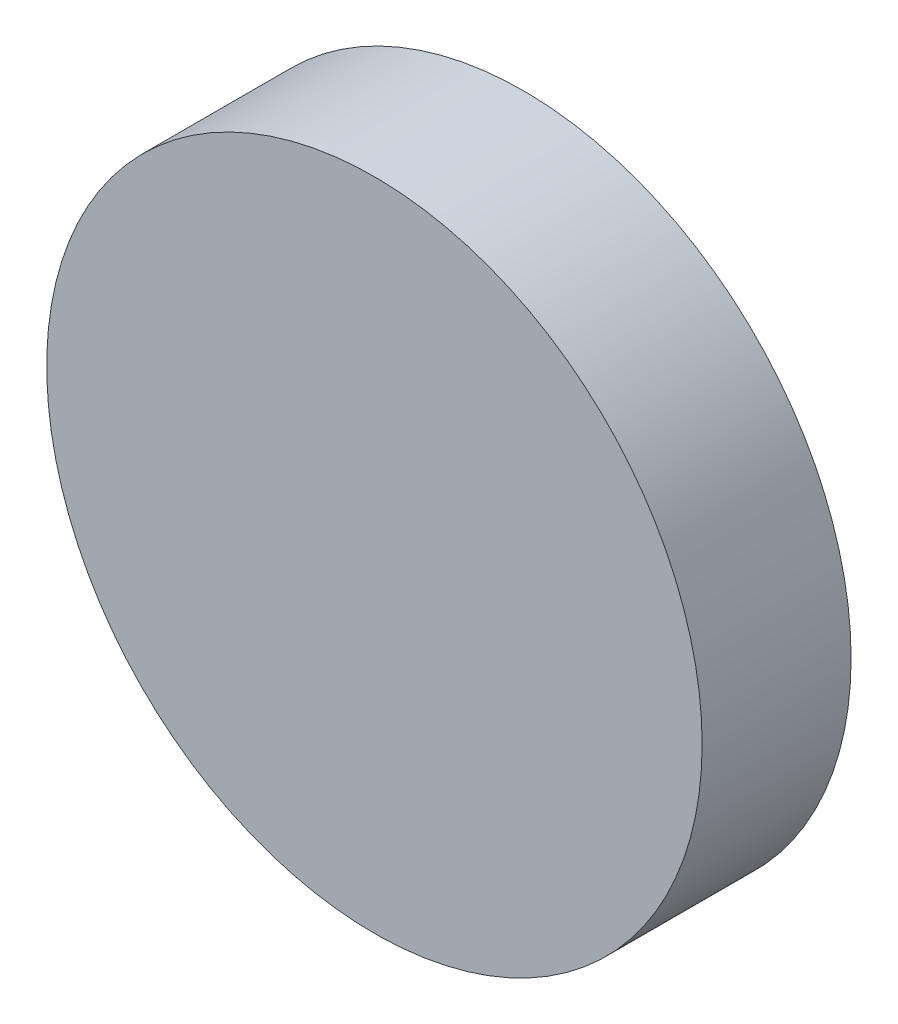
ISO-10303-21;
HEADER;
FILE_DESCRIPTION(('STEP AP214'),'2;1');
FILE_NAME('part.step','',(''),(''),'','','');
FILE_SCHEMA(('AUTOMOTIVE_DESIGN { 1 0 10303 214 1 1 1 1 }'));
ENDSEC;
DATA;
#1=APPLICATION_CONTEXT('core data for automotive mechanical design processes');
#2=APPLICATION_PROTOCOL_DEFINITION('international standard','automotive_design',2000,#1);
#3=PRODUCT_CONTEXT('',#1,'mechanical');
#4=PRODUCT('Part','Part','',(#3));
#5=PRODUCT_RELATED_PRODUCT_CATEGORY('part','',(#4));
#6=PRODUCT_DEFINITION_FORMATION('','',#4);
#7=PRODUCT_DEFINITION_CONTEXT('part definition',#1,'design');
#8=PRODUCT_DEFINITION('design','',#6,#7);
#9=PRODUCT_DEFINITION_SHAPE('','',#8);
#10=(LENGTH_UNIT() NAMED_UNIT(*) SI_UNIT(.MILLI.,.METRE.));
#11=(NAMED_UNIT(*) PLANE_ANGLE_UNIT() SI_UNIT($,.RADIAN.));
#12=(NAMED_UNIT(*) SI_UNIT($,.STERADIAN.) SOLID_ANGLE_UNIT());
#13=UNCERTAINTY_MEASURE_WITH_UNIT(LENGTH_MEASURE(1.E-05),#10,'distance_accuracy_value','');
#14=(GEOMETRIC_REPRESENTATION_CONTEXT(3) GLOBAL_UNCERTAINTY_ASSIGNED_CONTEXT((#13)) GLOBAL_UNIT_ASSIGNED_CONTEXT((#10,
#11,#12)) REPRESENTATION_CONTEXT('',''));
#15=CARTESIAN_POINT('',(0.,0.,0.));
#16=DIRECTION('',(0.,0.,1.));
#17=DIRECTION('',(1.,0.,0.));
#18=AXIS2_PLACEMENT_3D('',#15,#16,#17);
#19=CARTESIAN_POINT('',(0.,0.,5.));
#20=DIRECTION('',(0.,0.,-1.));
#21=DIRECTION('',(-1.,0.,0.));
#22=AXIS2_PLACEMENT_3D('',#19,#20,#21);
#23=CYLINDRICAL_SURFACE('',#22,11.);
#24=CARTESIAN_POINT('',(0.,0.,5.));
#25=DIRECTION('',(0.,0.,1.));
#26=DIRECTION('',(1.,0.,0.));
#27=AXIS2_PLACEMENT_3D('',#24,#25,#26);
#28=CIRCLE('',#27,11.);
#29=CARTESIAN_POINT('',(11.,0.,5.));
#30=VERTEX_POINT('',#29);
#31=EDGE_CURVE('E10',#30,#30,#28,.T.);
#32=ORIENTED_EDGE('',*,*,#31,.F.);
#33=EDGE_LOOP('',(#32));
#34=FACE_BOUND('',#33,.T.);
#35=CARTESIAN_POINT('',(0.,0.,0.));
#36=DIRECTION('',(0.,0.,1.));
#37=DIRECTION('',(1.,0.,0.));
#38=AXIS2_PLACEMENT_3D('',#35,#36,#37);
#39=CIRCLE('',#38,11.);
#40=CARTESIAN_POINT('',(11.,0.,0.));
#41=VERTEX_POINT('',#40);
#42=EDGE_CURVE('E34',#41,#41,#39,.T.);
#43=ORIENTED_EDGE('',*,*,#42,.T.);
#44=EDGE_LOOP('',(#43));
#45=FACE_BOUND('',#44,.T.);
#46=ADVANCED_FACE('F31',(#34,#45),#23,.T.);
#47=CARTESIAN_POINT('',(0.,0.,5.));
#48=DIRECTION('',(0.,0.,1.));
#49=DIRECTION('',(1.,0.,0.));
#50=AXIS2_PLACEMENT_3D('',#47,#48,#49);
#51=PLANE('',#50);
#52=ORIENTED_EDGE('',*,*,#31,.T.);
#53=EDGE_LOOP('',(#52));
#54=FACE_BOUND('',#53,.T.);
#55=ADVANCED_FACE('F61',(#54),#51,.T.);
#56=CARTESIAN_POINT('',(0.,0.,0.));
#57=DIRECTION('',(0.,0.,1.));
#58=DIRECTION('',(1.,0.,0.));
#59=AXIS2_PLACEMENT_3D('',#56,#57,#58);
#60=PLANE('',#59);
#61=CARTESIAN_POINT('',(0.,0.,0.));
#62=DIRECTION('',(0.,0.,1.));
#63=DIRECTION('',(1.,0.,0.));
#64=AXIS2_PLACEMENT_3D('',#61,#62,#63);
#65=CIRCLE('',#64,8.5);
#66=CARTESIAN_POINT('',(8.5,0.,0.));
#67=VERTEX_POINT('',#66);
#68=EDGE_CURVE('E43',#67,#67,#65,.T.);
#69=ORIENTED_EDGE('',*,*,#68,.T.);
#70=EDGE_LOOP('',(#69));
#71=FACE_BOUND('',#70,.T.);
#72=ORIENTED_EDGE('',*,*,#42,.F.);
#73=EDGE_LOOP('',(#72));
#74=FACE_BOUND('',#73,.T.);
#75=ADVANCED_FACE('F58',(#71,#74),#60,.F.);
#76=CARTESIAN_POINT('',(0.,0.,3.));
#77=DIRECTION('',(0.,0.,-1.));
#78=DIRECTION('',(-1.,0.,0.));
#79=AXIS2_PLACEMENT_3D('',#76,#77,#78);
#80=CYLINDRICAL_SURFACE('',#79,8.5);
#81=CARTESIAN_POINT('',(0.,0.,3.));
#82=DIRECTION('',(0.,0.,1.));
#83=DIRECTION('',(1.,0.,0.));
#84=AXIS2_PLACEMENT_3D('',#81,#82,#83);
#85=CIRCLE('',#84,8.5);
#86=CARTESIAN_POINT('',(8.5,0.,3.));
#87=VERTEX_POINT('',#86);
#88=EDGE_CURVE('E41',#87,#87,#85,.T.);
#89=ORIENTED_EDGE('',*,*,#88,.T.);
#90=EDGE_LOOP('',(#89));
#91=FACE_BOUND('',#90,.T.);
#92=ORIENTED_EDGE('',*,*,#68,.F.);
#93=EDGE_LOOP('',(#92));
#94=FACE_BOUND('',#93,.T.);
#95=ADVANCED_FACE('F49',(#91,#94),#80,.F.);
#96=CARTESIAN_POINT('',(0.,0.,3.));
#97=DIRECTION('',(0.,0.,1.));
#98=DIRECTION('',(1.,0.,0.));
#99=AXIS2_PLACEMENT_3D('',#96,#97,#98);
#100=PLANE('',#99);
#101=ORIENTED_EDGE('',*,*,#88,.F.);
#102=EDGE_LOOP('',(#101));
#103=FACE_BOUND('',#102,.T.);
#104=ADVANCED_FACE('F52',(#103),#100,.F.);
#105=CLOSED_SHELL('',(#46,#55,#75,#95,#104));
#106=MANIFOLD_SOLID_BREP('B2',#105);
#107=ADVANCED_BREP_SHAPE_REPRESENTATION('',(#18,#106),#14);
#108=SHAPE_DEFINITION_REPRESENTATION(#9,#107);
ENDSEC;
END-ISO-10303-21;
